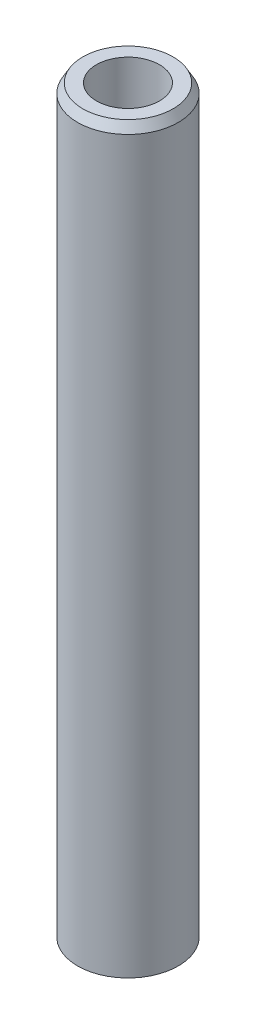
ISO-10303-21;
HEADER;
FILE_DESCRIPTION(('STEP AP214'),'2;1');
FILE_NAME('part.step','',(''),(''),'','','');
FILE_SCHEMA(('AUTOMOTIVE_DESIGN { 1 0 10303 214 1 1 1 1 }'));
ENDSEC;
DATA;
#1=APPLICATION_CONTEXT('core data for automotive mechanical design processes');
#2=APPLICATION_PROTOCOL_DEFINITION('international standard','automotive_design',2000,#1);
#3=PRODUCT_CONTEXT('',#1,'mechanical');
#4=PRODUCT('Part','Part','',(#3));
#5=PRODUCT_RELATED_PRODUCT_CATEGORY('part','',(#4));
#6=PRODUCT_DEFINITION_FORMATION('','',#4);
#7=PRODUCT_DEFINITION_CONTEXT('part definition',#1,'design');
#8=PRODUCT_DEFINITION('design','',#6,#7);
#9=PRODUCT_DEFINITION_SHAPE('','',#8);
#10=(LENGTH_UNIT() NAMED_UNIT(*) SI_UNIT(.MILLI.,.METRE.));
#11=(NAMED_UNIT(*) PLANE_ANGLE_UNIT() SI_UNIT($,.RADIAN.));
#12=(NAMED_UNIT(*) SI_UNIT($,.STERADIAN.) SOLID_ANGLE_UNIT());
#13=UNCERTAINTY_MEASURE_WITH_UNIT(LENGTH_MEASURE(1.E-05),#10,'distance_accuracy_value','');
#14=(GEOMETRIC_REPRESENTATION_CONTEXT(3) GLOBAL_UNCERTAINTY_ASSIGNED_CONTEXT((#13)) GLOBAL_UNIT_ASSIGNED_CONTEXT((#10,
#11,#12)) REPRESENTATION_CONTEXT('',''));
#15=CARTESIAN_POINT('',(0.,0.,0.));
#16=DIRECTION('',(0.,0.,1.));
#17=DIRECTION('',(1.,0.,0.));
#18=AXIS2_PLACEMENT_3D('',#15,#16,#17);
#19=CARTESIAN_POINT('',(0.,184.882599876554,0.));
#20=DIRECTION('',(0.,-1.,0.));
#21=DIRECTION('',(0.,0.,-1.));
#22=AXIS2_PLACEMENT_3D('',#19,#20,#21);
#23=CYLINDRICAL_SURFACE('',#22,12.5);
#24=CARTESIAN_POINT('',(0.,182.612382293915,0.));
#25=DIRECTION('',(0.,1.,0.));
#26=DIRECTION('',(0.,0.,1.));
#27=AXIS2_PLACEMENT_3D('',#24,#25,#26);
#28=CIRCLE('',#27,12.5);
#29=CARTESIAN_POINT('',(0.,182.612382293915,12.5));
#30=VERTEX_POINT('',#29);
#31=EDGE_CURVE('E50',#30,#30,#28,.F.);
#32=ORIENTED_EDGE('',*,*,#31,.T.);
#33=EDGE_LOOP('',(#32));
#34=FACE_BOUND('',#33,.T.);
#35=CARTESIAN_POINT('',(0.,1.31071073245567,0.));
#36=DIRECTION('',(0.,1.,0.));
#37=DIRECTION('',(0.,0.,1.));
#38=AXIS2_PLACEMENT_3D('',#35,#36,#37);
#39=CIRCLE('',#38,12.5);
#40=CARTESIAN_POINT('',(0.,1.31071073245567,12.5));
#41=VERTEX_POINT('',#40);
#42=EDGE_CURVE('E51',#41,#41,#39,.T.);
#43=ORIENTED_EDGE('',*,*,#42,.T.);
#44=EDGE_LOOP('',(#43));
#45=FACE_BOUND('',#44,.T.);
#46=ADVANCED_FACE('F39',(#34,#45),#23,.T.);
#47=CARTESIAN_POINT('',(0.,184.882599876554,0.));
#48=DIRECTION('',(0.,1.,0.));
#49=DIRECTION('',(0.,0.,1.));
#50=AXIS2_PLACEMENT_3D('',#47,#48,#49);
#51=PLANE('',#50);
#52=CARTESIAN_POINT('',(0.,184.882599876554,0.));
#53=DIRECTION('',(0.,1.,0.));
#54=DIRECTION('',(0.,0.,1.));
#55=AXIS2_PLACEMENT_3D('',#52,#53,#54);
#56=CIRCLE('',#55,11.1892892675444);
#57=CARTESIAN_POINT('',(0.,184.882599876554,11.1892892675444));
#58=VERTEX_POINT('',#57);
#59=EDGE_CURVE('E54',#58,#58,#56,.T.);
#60=ORIENTED_EDGE('',*,*,#59,.T.);
#61=EDGE_LOOP('',(#60));
#62=FACE_BOUND('',#61,.T.);
#63=CARTESIAN_POINT('',(0.,184.882599876554,0.));
#64=DIRECTION('',(0.,1.,0.));
#65=DIRECTION('',(0.,0.,1.));
#66=AXIS2_PLACEMENT_3D('',#63,#64,#65);
#67=CIRCLE('',#66,7.814979518824);
#68=CARTESIAN_POINT('',(0.,184.882599876554,7.814979518824));
#69=VERTEX_POINT('',#68);
#70=EDGE_CURVE('E58',#69,#69,#67,.T.);
#71=ORIENTED_EDGE('',*,*,#70,.F.);
#72=EDGE_LOOP('',(#71));
#73=FACE_BOUND('',#72,.T.);
#74=ADVANCED_FACE('F69',(#62,#73),#51,.T.);
#75=CARTESIAN_POINT('',(0.,0.,0.));
#76=DIRECTION('',(0.,1.,0.));
#77=DIRECTION('',(0.,0.,1.));
#78=AXIS2_PLACEMENT_3D('',#75,#76,#77);
#79=PLANE('',#78);
#80=CARTESIAN_POINT('',(0.,0.,0.));
#81=DIRECTION('',(0.,1.,0.));
#82=DIRECTION('',(0.,0.,1.));
#83=AXIS2_PLACEMENT_3D('',#80,#81,#82);
#84=CIRCLE('',#83,10.2297824173609);
#85=CARTESIAN_POINT('',(0.,0.,10.2297824173609));
#86=VERTEX_POINT('',#85);
#87=EDGE_CURVE('E10',#86,#86,#84,.F.);
#88=ORIENTED_EDGE('',*,*,#87,.T.);
#89=EDGE_LOOP('',(#88));
#90=FACE_BOUND('',#89,.T.);
#91=CARTESIAN_POINT('',(0.,0.,0.));
#92=DIRECTION('',(0.,1.,0.));
#93=DIRECTION('',(0.,0.,1.));
#94=AXIS2_PLACEMENT_3D('',#91,#92,#93);
#95=CIRCLE('',#94,7.814979518824);
#96=CARTESIAN_POINT('',(0.,0.,7.814979518824));
#97=VERTEX_POINT('',#96);
#98=EDGE_CURVE('E63',#97,#97,#95,.T.);
#99=ORIENTED_EDGE('',*,*,#98,.T.);
#100=EDGE_LOOP('',(#99));
#101=FACE_BOUND('',#100,.T.);
#102=ADVANCED_FACE('F75',(#90,#101),#79,.F.);
#103=CARTESIAN_POINT('',(0.,184.882599876554,0.));
#104=DIRECTION('',(0.,-1.,0.));
#105=DIRECTION('',(0.,0.,-1.));
#106=AXIS2_PLACEMENT_3D('',#103,#104,#105);
#107=CYLINDRICAL_SURFACE('',#106,7.814979518824);
#108=ORIENTED_EDGE('',*,*,#70,.T.);
#109=EDGE_LOOP('',(#108));
#110=FACE_BOUND('',#109,.T.);
#111=ORIENTED_EDGE('',*,*,#98,.F.);
#112=EDGE_LOOP('',(#111));
#113=FACE_BOUND('',#112,.T.);
#114=ADVANCED_FACE('F70',(#110,#113),#107,.F.);
#115=CARTESIAN_POINT('',(0.,184.882599876554,0.));
#116=DIRECTION('',(0.,-1.,0.));
#117=DIRECTION('',(0.,0.,-1.));
#118=AXIS2_PLACEMENT_3D('',#115,#116,#117);
#119=CONICAL_SURFACE('',#118,11.1892892675444,0.523598775598297);
#120=ORIENTED_EDGE('',*,*,#31,.F.);
#121=EDGE_LOOP('',(#120));
#122=FACE_BOUND('',#121,.T.);
#123=ORIENTED_EDGE('',*,*,#59,.F.);
#124=EDGE_LOOP('',(#123));
#125=FACE_BOUND('',#124,.T.);
#126=ADVANCED_FACE('F81',(#122,#125),#119,.T.);
#127=CARTESIAN_POINT('',(0.,1.31071073245567,0.));
#128=DIRECTION('',(0.,1.,0.));
#129=DIRECTION('',(0.,0.,1.));
#130=AXIS2_PLACEMENT_3D('',#127,#128,#129);
#131=CONICAL_SURFACE('',#130,12.5,1.0471975511966);
#132=ORIENTED_EDGE('',*,*,#87,.F.);
#133=EDGE_LOOP('',(#132));
#134=FACE_BOUND('',#133,.T.);
#135=ORIENTED_EDGE('',*,*,#42,.F.);
#136=EDGE_LOOP('',(#135));
#137=FACE_BOUND('',#136,.T.);
#138=ADVANCED_FACE('F45',(#134,#137),#131,.T.);
#139=CLOSED_SHELL('',(#46,#74,#102,#114,#126,#138));
#140=MANIFOLD_SOLID_BREP('B2',#139);
#141=ADVANCED_BREP_SHAPE_REPRESENTATION('',(#18,#140),#14);
#142=SHAPE_DEFINITION_REPRESENTATION(#9,#141);
ENDSEC;
END-ISO-10303-21;
